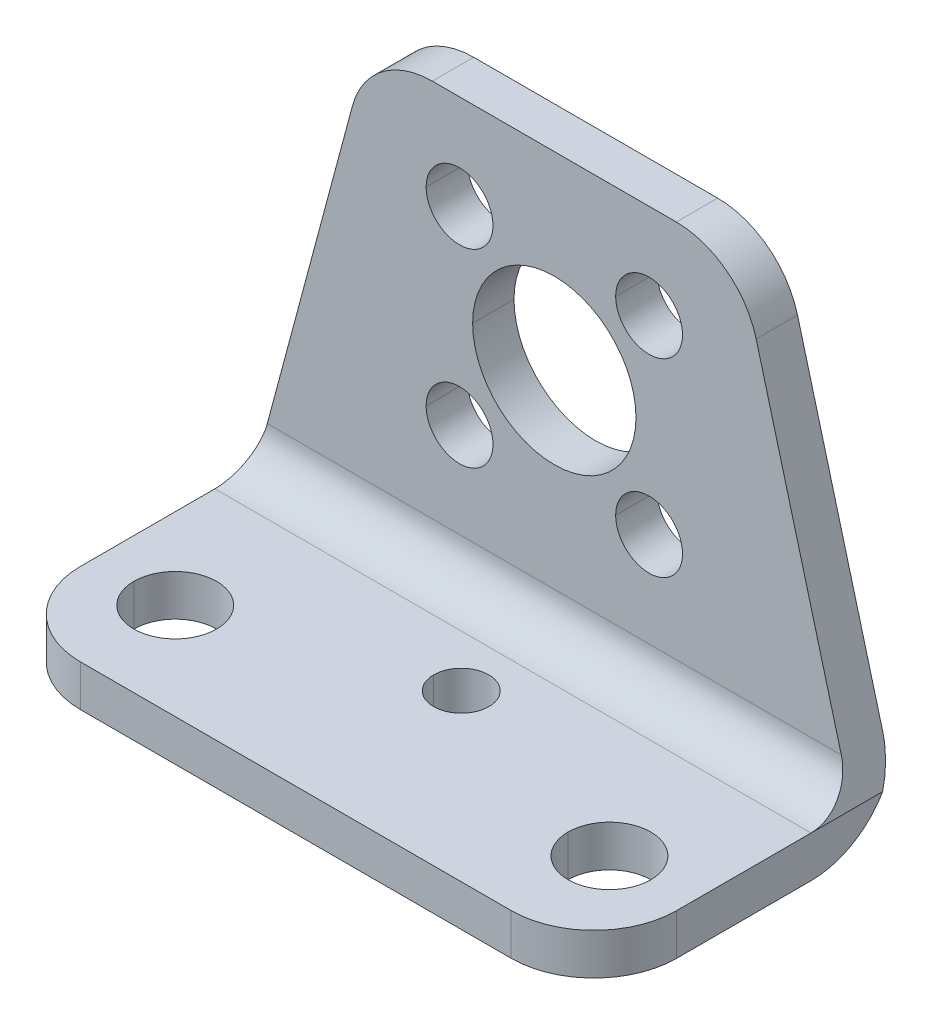
ISO-10303-21;
HEADER;
FILE_DESCRIPTION(('STEP AP214'),'2;1');
FILE_NAME('part.step','',(''),(''),'','','');
FILE_SCHEMA(('AUTOMOTIVE_DESIGN { 1 0 10303 214 1 1 1 1 }'));
ENDSEC;
DATA;
#1=APPLICATION_CONTEXT('core data for automotive mechanical design processes');
#2=APPLICATION_PROTOCOL_DEFINITION('international standard','automotive_design',2000,#1);
#3=PRODUCT_CONTEXT('',#1,'mechanical');
#4=PRODUCT('Part','Part','',(#3));
#5=PRODUCT_RELATED_PRODUCT_CATEGORY('part','',(#4));
#6=PRODUCT_DEFINITION_FORMATION('','',#4);
#7=PRODUCT_DEFINITION_CONTEXT('part definition',#1,'design');
#8=PRODUCT_DEFINITION('design','',#6,#7);
#9=PRODUCT_DEFINITION_SHAPE('','',#8);
#10=(LENGTH_UNIT() NAMED_UNIT(*) SI_UNIT(.MILLI.,.METRE.));
#11=(NAMED_UNIT(*) PLANE_ANGLE_UNIT() SI_UNIT($,.RADIAN.));
#12=(NAMED_UNIT(*) SI_UNIT($,.STERADIAN.) SOLID_ANGLE_UNIT());
#13=UNCERTAINTY_MEASURE_WITH_UNIT(LENGTH_MEASURE(1.E-05),#10,'distance_accuracy_value','');
#14=(GEOMETRIC_REPRESENTATION_CONTEXT(3) GLOBAL_UNCERTAINTY_ASSIGNED_CONTEXT((#13)) GLOBAL_UNIT_ASSIGNED_CONTEXT((#10,
#11,#12)) REPRESENTATION_CONTEXT('',''));
#15=CARTESIAN_POINT('',(0.,0.,0.));
#16=DIRECTION('',(0.,0.,1.));
#17=DIRECTION('',(1.,0.,0.));
#18=AXIS2_PLACEMENT_3D('',#15,#16,#17);
#19=CARTESIAN_POINT('',(-8.99016510622397,7.87399999999886,6.096));
#20=DIRECTION('',(0.,0.,1.));
#21=DIRECTION('',(0.608761429008703,-0.793353340291249,0.));
#22=AXIS2_PLACEMENT_3D('',#19,#20,#21);
#23=CYLINDRICAL_SURFACE('',#22,6.096);
#24=DIRECTION('',(0.,0.,-1.));
#25=VECTOR('',#24,1.);
#26=CARTESIAN_POINT('',(-8.99016510622461,13.97,6.096));
#27=LINE('',#26,#25);
#28=CARTESIAN_POINT('',(-8.99016510622461,13.97,3.048));
#29=VERTEX_POINT('',#28);
#30=CARTESIAN_POINT('',(-8.99016510622461,13.97,0.));
#31=VERTEX_POINT('',#30);
#32=EDGE_CURVE('E11',#29,#31,#27,.T.);
#33=ORIENTED_EDGE('',*,*,#32,.T.);
#34=CARTESIAN_POINT('',(-8.99016510622397,7.87399999999886,0.));
#35=DIRECTION('',(0.,0.,1.));
#36=DIRECTION('',(1.,0.,0.));
#37=AXIS2_PLACEMENT_3D('',#34,#35,#36);
#38=CIRCLE('',#37,6.096);
#39=CARTESIAN_POINT('',(-14.878448943283,9.45176089894499,0.));
#40=VERTEX_POINT('',#39);
#41=EDGE_CURVE('E25',#31,#40,#38,.T.);
#42=ORIENTED_EDGE('',*,*,#41,.T.);
#43=DIRECTION('',(0.,0.,-1.));
#44=VECTOR('',#43,1.);
#45=CARTESIAN_POINT('',(-14.878448943283,9.45176089894499,6.096));
#46=LINE('',#45,#44);
#47=CARTESIAN_POINT('',(-14.878448943283,9.45176089894499,3.048));
#48=VERTEX_POINT('',#47);
#49=EDGE_CURVE('E523',#48,#40,#46,.T.);
#50=ORIENTED_EDGE('',*,*,#49,.F.);
#51=CARTESIAN_POINT('',(-8.99016510622397,7.87399999999886,3.048));
#52=DIRECTION('',(0.,0.,-1.));
#53=DIRECTION('',(-1.,0.,0.));
#54=AXIS2_PLACEMENT_3D('',#51,#52,#53);
#55=CIRCLE('',#54,6.096);
#56=EDGE_CURVE('E519',#48,#29,#55,.T.);
#57=ORIENTED_EDGE('',*,*,#56,.T.);
#58=EDGE_LOOP('',(#33,#42,#50,#57));
#59=FACE_BOUND('',#58,.T.);
#60=ADVANCED_FACE('F17',(#59),#23,.T.);
#61=CARTESIAN_POINT('',(21.971,13.97,3.048));
#62=DIRECTION('',(0.,0.,-1.));
#63=DIRECTION('',(-1.,0.,0.));
#64=AXIS2_PLACEMENT_3D('',#61,#62,#63);
#65=PLANE('',#64);
#66=CARTESIAN_POINT('',(0.,0.,3.048));
#67=DIRECTION('',(0.,0.,1.));
#68=DIRECTION('',(1.,0.,0.));
#69=AXIS2_PLACEMENT_3D('',#66,#67,#68);
#70=CIRCLE('',#69,6.0198);
#71=CARTESIAN_POINT('',(6.0198,0.,3.048));
#72=VERTEX_POINT('',#71);
#73=CARTESIAN_POINT('',(-6.0198,0.,3.048));
#74=VERTEX_POINT('',#73);
#75=EDGE_CURVE('E514',#72,#74,#70,.T.);
#76=ORIENTED_EDGE('',*,*,#75,.F.);
#77=CARTESIAN_POINT('',(0.,0.,3.048));
#78=DIRECTION('',(0.,0.,1.));
#79=DIRECTION('',(1.,0.,0.));
#80=AXIS2_PLACEMENT_3D('',#77,#78,#79);
#81=CIRCLE('',#80,6.0198);
#82=EDGE_CURVE('E509',#74,#72,#81,.T.);
#83=ORIENTED_EDGE('',*,*,#82,.F.);
#84=EDGE_LOOP('',(#76,#83));
#85=FACE_BOUND('',#84,.T.);
#86=CARTESIAN_POINT('',(-6.985,6.985,3.048));
#87=DIRECTION('',(0.,0.,1.));
#88=DIRECTION('',(1.,0.,0.));
#89=AXIS2_PLACEMENT_3D('',#86,#87,#88);
#90=CIRCLE('',#89,2.4638);
#91=CARTESIAN_POINT('',(-4.5212,6.985,3.048));
#92=VERTEX_POINT('',#91);
#93=CARTESIAN_POINT('',(-9.4488,6.985,3.048));
#94=VERTEX_POINT('',#93);
#95=EDGE_CURVE('E504',#92,#94,#90,.T.);
#96=ORIENTED_EDGE('',*,*,#95,.F.);
#97=CARTESIAN_POINT('',(-6.985,6.985,3.048));
#98=DIRECTION('',(0.,0.,1.));
#99=DIRECTION('',(1.,0.,0.));
#100=AXIS2_PLACEMENT_3D('',#97,#98,#99);
#101=CIRCLE('',#100,2.4638);
#102=EDGE_CURVE('E499',#94,#92,#101,.T.);
#103=ORIENTED_EDGE('',*,*,#102,.F.);
#104=EDGE_LOOP('',(#96,#103));
#105=FACE_BOUND('',#104,.T.);
#106=CARTESIAN_POINT('',(6.985,6.985,3.048));
#107=DIRECTION('',(0.,0.,1.));
#108=DIRECTION('',(1.,0.,0.));
#109=AXIS2_PLACEMENT_3D('',#106,#107,#108);
#110=CIRCLE('',#109,2.4638);
#111=CARTESIAN_POINT('',(9.4488,6.985,3.048));
#112=VERTEX_POINT('',#111);
#113=CARTESIAN_POINT('',(4.5212,6.985,3.048));
#114=VERTEX_POINT('',#113);
#115=EDGE_CURVE('E494',#112,#114,#110,.T.);
#116=ORIENTED_EDGE('',*,*,#115,.F.);
#117=CARTESIAN_POINT('',(6.985,6.985,3.048));
#118=DIRECTION('',(0.,0.,1.));
#119=DIRECTION('',(1.,0.,0.));
#120=AXIS2_PLACEMENT_3D('',#117,#118,#119);
#121=CIRCLE('',#120,2.4638);
#122=EDGE_CURVE('E489',#114,#112,#121,.T.);
#123=ORIENTED_EDGE('',*,*,#122,.F.);
#124=EDGE_LOOP('',(#116,#123));
#125=FACE_BOUND('',#124,.T.);
#126=CARTESIAN_POINT('',(-6.985,-6.985,3.048));
#127=DIRECTION('',(0.,0.,1.));
#128=DIRECTION('',(1.,0.,0.));
#129=AXIS2_PLACEMENT_3D('',#126,#127,#128);
#130=CIRCLE('',#129,2.4638);
#131=CARTESIAN_POINT('',(-4.5212,-6.985,3.048));
#132=VERTEX_POINT('',#131);
#133=CARTESIAN_POINT('',(-9.4488,-6.985,3.048));
#134=VERTEX_POINT('',#133);
#135=EDGE_CURVE('E484',#132,#134,#130,.T.);
#136=ORIENTED_EDGE('',*,*,#135,.F.);
#137=CARTESIAN_POINT('',(-6.985,-6.985,3.048));
#138=DIRECTION('',(0.,0.,1.));
#139=DIRECTION('',(1.,0.,0.));
#140=AXIS2_PLACEMENT_3D('',#137,#138,#139);
#141=CIRCLE('',#140,2.4638);
#142=EDGE_CURVE('E479',#134,#132,#141,.T.);
#143=ORIENTED_EDGE('',*,*,#142,.F.);
#144=EDGE_LOOP('',(#136,#143));
#145=FACE_BOUND('',#144,.T.);
#146=CARTESIAN_POINT('',(6.985,-6.985,3.048));
#147=DIRECTION('',(0.,0.,1.));
#148=DIRECTION('',(1.,0.,0.));
#149=AXIS2_PLACEMENT_3D('',#146,#147,#148);
#150=CIRCLE('',#149,2.4638);
#151=CARTESIAN_POINT('',(9.4488,-6.985,3.048));
#152=VERTEX_POINT('',#151);
#153=CARTESIAN_POINT('',(4.5212,-6.985,3.048));
#154=VERTEX_POINT('',#153);
#155=EDGE_CURVE('E474',#152,#154,#150,.T.);
#156=ORIENTED_EDGE('',*,*,#155,.F.);
#157=CARTESIAN_POINT('',(6.985,-6.985,3.048));
#158=DIRECTION('',(0.,0.,1.));
#159=DIRECTION('',(1.,0.,0.));
#160=AXIS2_PLACEMENT_3D('',#157,#158,#159);
#161=CIRCLE('',#160,2.4638);
#162=EDGE_CURVE('E469',#154,#152,#161,.T.);
#163=ORIENTED_EDGE('',*,*,#162,.F.);
#164=EDGE_LOOP('',(#156,#163));
#165=FACE_BOUND('',#164,.T.);
#166=DIRECTION('',(0.258819045102513,0.96592582628907,0.));
#167=VECTOR('',#166,1.);
#168=CARTESIAN_POINT('',(-11.2804441465483,22.8796976062359,3.048));
#169=LINE('',#168,#167);
#170=CARTESIAN_POINT('',(-21.15429086147,-13.97,3.048));
#171=VERTEX_POINT('',#170);
#172=EDGE_CURVE('E464',#171,#48,#169,.T.);
#173=ORIENTED_EDGE('',*,*,#172,.F.);
#174=DIRECTION('',(-1.,0.,0.));
#175=VECTOR('',#174,1.);
#176=CARTESIAN_POINT('',(21.971,-13.97,3.048));
#177=LINE('',#176,#175);
#178=CARTESIAN_POINT('',(21.15429086147,-13.97,3.048));
#179=VERTEX_POINT('',#178);
#180=EDGE_CURVE('E459',#179,#171,#177,.T.);
#181=ORIENTED_EDGE('',*,*,#180,.F.);
#182=DIRECTION('',(0.258819045102513,-0.96592582628907,0.));
#183=VECTOR('',#182,1.);
#184=CARTESIAN_POINT('',(14.2240000000002,11.8941976062362,3.048));
#185=LINE('',#184,#183);
#186=CARTESIAN_POINT('',(14.878448943283,9.45176089894499,3.048));
#187=VERTEX_POINT('',#186);
#188=EDGE_CURVE('E454',#187,#179,#185,.T.);
#189=ORIENTED_EDGE('',*,*,#188,.F.);
#190=CARTESIAN_POINT('',(8.99016510622397,7.87399999999886,3.048));
#191=DIRECTION('',(0.,0.,-1.));
#192=DIRECTION('',(-1.,0.,0.));
#193=AXIS2_PLACEMENT_3D('',#190,#191,#192);
#194=CIRCLE('',#193,6.096);
#195=CARTESIAN_POINT('',(8.99016510622461,13.97,3.048));
#196=VERTEX_POINT('',#195);
#197=EDGE_CURVE('E449',#196,#187,#194,.T.);
#198=ORIENTED_EDGE('',*,*,#197,.F.);
#199=DIRECTION('',(-1.,0.,0.));
#200=VECTOR('',#199,1.);
#201=CARTESIAN_POINT('',(21.971,13.97,3.048));
#202=LINE('',#201,#200);
#203=EDGE_CURVE('E444',#196,#29,#202,.T.);
#204=ORIENTED_EDGE('',*,*,#203,.T.);
#205=ORIENTED_EDGE('',*,*,#56,.F.);
#206=EDGE_LOOP('',(#173,#181,#189,#198,#204,#205));
#207=FACE_BOUND('',#206,.T.);
#208=ADVANCED_FACE('F538',(#85,#105,#125,#145,#165,#207),#65,.F.);
#209=CARTESIAN_POINT('',(21.971,13.97,0.));
#210=DIRECTION('',(0.,-1.,0.));
#211=DIRECTION('',(0.,0.,-1.));
#212=AXIS2_PLACEMENT_3D('',#209,#210,#211);
#213=PLANE('',#212);
#214=DIRECTION('',(-1.,0.,0.));
#215=VECTOR('',#214,1.);
#216=CARTESIAN_POINT('',(21.971,13.97,0.));
#217=LINE('',#216,#215);
#218=CARTESIAN_POINT('',(8.99016510622461,13.97,0.));
#219=VERTEX_POINT('',#218);
#220=EDGE_CURVE('E440',#219,#31,#217,.T.);
#221=ORIENTED_EDGE('',*,*,#220,.T.);
#222=ORIENTED_EDGE('',*,*,#32,.F.);
#223=ORIENTED_EDGE('',*,*,#203,.F.);
#224=DIRECTION('',(0.,0.,-1.));
#225=VECTOR('',#224,1.);
#226=CARTESIAN_POINT('',(8.99016510622461,13.97,6.096));
#227=LINE('',#226,#225);
#228=EDGE_CURVE('E436',#196,#219,#227,.T.);
#229=ORIENTED_EDGE('',*,*,#228,.T.);
#230=EDGE_LOOP('',(#221,#222,#223,#229));
#231=FACE_BOUND('',#230,.T.);
#232=ADVANCED_FACE('F542',(#231),#213,.F.);
#233=CARTESIAN_POINT('',(8.99016510622397,7.87399999999886,6.096));
#234=DIRECTION('',(0.,0.,1.));
#235=DIRECTION('',(-0.608761429008703,-0.793353340291248,0.));
#236=AXIS2_PLACEMENT_3D('',#233,#234,#235);
#237=CYLINDRICAL_SURFACE('',#236,6.096);
#238=DIRECTION('',(0.,0.,-1.));
#239=VECTOR('',#238,1.);
#240=CARTESIAN_POINT('',(14.878448943283,9.45176089894499,6.096));
#241=LINE('',#240,#239);
#242=CARTESIAN_POINT('',(14.878448943283,9.45176089894499,0.));
#243=VERTEX_POINT('',#242);
#244=EDGE_CURVE('E432',#187,#243,#241,.T.);
#245=ORIENTED_EDGE('',*,*,#244,.T.);
#246=CARTESIAN_POINT('',(8.99016510622397,7.87399999999886,0.));
#247=DIRECTION('',(0.,0.,1.));
#248=DIRECTION('',(1.,0.,0.));
#249=AXIS2_PLACEMENT_3D('',#246,#247,#248);
#250=CIRCLE('',#249,6.096);
#251=EDGE_CURVE('E427',#243,#219,#250,.T.);
#252=ORIENTED_EDGE('',*,*,#251,.T.);
#253=ORIENTED_EDGE('',*,*,#228,.F.);
#254=ORIENTED_EDGE('',*,*,#197,.T.);
#255=EDGE_LOOP('',(#245,#252,#253,#254));
#256=FACE_BOUND('',#255,.T.);
#257=ADVANCED_FACE('F569',(#256),#237,.T.);
#258=CARTESIAN_POINT('',(21.971,-13.97,0.));
#259=DIRECTION('',(0.,0.,1.));
#260=DIRECTION('',(1.,0.,0.));
#261=AXIS2_PLACEMENT_3D('',#258,#259,#260);
#262=PLANE('',#261);
#263=CARTESIAN_POINT('',(0.,0.,0.));
#264=DIRECTION('',(0.,0.,1.));
#265=DIRECTION('',(1.,0.,0.));
#266=AXIS2_PLACEMENT_3D('',#263,#264,#265);
#267=CIRCLE('',#266,6.0198);
#268=CARTESIAN_POINT('',(6.0198,0.,0.));
#269=VERTEX_POINT('',#268);
#270=CARTESIAN_POINT('',(-6.0198,0.,0.));
#271=VERTEX_POINT('',#270);
#272=EDGE_CURVE('E423',#269,#271,#267,.T.);
#273=ORIENTED_EDGE('',*,*,#272,.T.);
#274=CARTESIAN_POINT('',(0.,0.,0.));
#275=DIRECTION('',(0.,0.,1.));
#276=DIRECTION('',(1.,0.,0.));
#277=AXIS2_PLACEMENT_3D('',#274,#275,#276);
#278=CIRCLE('',#277,6.0198);
#279=EDGE_CURVE('E419',#271,#269,#278,.T.);
#280=ORIENTED_EDGE('',*,*,#279,.T.);
#281=EDGE_LOOP('',(#273,#280));
#282=FACE_BOUND('',#281,.T.);
#283=CARTESIAN_POINT('',(-6.985,6.985,0.));
#284=DIRECTION('',(0.,0.,1.));
#285=DIRECTION('',(1.,0.,0.));
#286=AXIS2_PLACEMENT_3D('',#283,#284,#285);
#287=CIRCLE('',#286,2.4638);
#288=CARTESIAN_POINT('',(-4.5212,6.985,0.));
#289=VERTEX_POINT('',#288);
#290=CARTESIAN_POINT('',(-9.4488,6.985,0.));
#291=VERTEX_POINT('',#290);
#292=EDGE_CURVE('E415',#289,#291,#287,.T.);
#293=ORIENTED_EDGE('',*,*,#292,.T.);
#294=CARTESIAN_POINT('',(-6.985,6.985,0.));
#295=DIRECTION('',(0.,0.,1.));
#296=DIRECTION('',(1.,0.,0.));
#297=AXIS2_PLACEMENT_3D('',#294,#295,#296);
#298=CIRCLE('',#297,2.4638);
#299=EDGE_CURVE('E411',#291,#289,#298,.T.);
#300=ORIENTED_EDGE('',*,*,#299,.T.);
#301=EDGE_LOOP('',(#293,#300));
#302=FACE_BOUND('',#301,.T.);
#303=CARTESIAN_POINT('',(6.985,6.985,0.));
#304=DIRECTION('',(0.,0.,1.));
#305=DIRECTION('',(1.,0.,0.));
#306=AXIS2_PLACEMENT_3D('',#303,#304,#305);
#307=CIRCLE('',#306,2.4638);
#308=CARTESIAN_POINT('',(9.4488,6.985,0.));
#309=VERTEX_POINT('',#308);
#310=CARTESIAN_POINT('',(4.5212,6.985,0.));
#311=VERTEX_POINT('',#310);
#312=EDGE_CURVE('E407',#309,#311,#307,.T.);
#313=ORIENTED_EDGE('',*,*,#312,.T.);
#314=CARTESIAN_POINT('',(6.985,6.985,0.));
#315=DIRECTION('',(0.,0.,1.));
#316=DIRECTION('',(1.,0.,0.));
#317=AXIS2_PLACEMENT_3D('',#314,#315,#316);
#318=CIRCLE('',#317,2.4638);
#319=EDGE_CURVE('E403',#311,#309,#318,.T.);
#320=ORIENTED_EDGE('',*,*,#319,.T.);
#321=EDGE_LOOP('',(#313,#320));
#322=FACE_BOUND('',#321,.T.);
#323=CARTESIAN_POINT('',(-6.985,-6.985,0.));
#324=DIRECTION('',(0.,0.,1.));
#325=DIRECTION('',(1.,0.,0.));
#326=AXIS2_PLACEMENT_3D('',#323,#324,#325);
#327=CIRCLE('',#326,2.4638);
#328=CARTESIAN_POINT('',(-4.5212,-6.985,0.));
#329=VERTEX_POINT('',#328);
#330=CARTESIAN_POINT('',(-9.4488,-6.985,0.));
#331=VERTEX_POINT('',#330);
#332=EDGE_CURVE('E399',#329,#331,#327,.T.);
#333=ORIENTED_EDGE('',*,*,#332,.T.);
#334=CARTESIAN_POINT('',(-6.985,-6.985,0.));
#335=DIRECTION('',(0.,0.,1.));
#336=DIRECTION('',(1.,0.,0.));
#337=AXIS2_PLACEMENT_3D('',#334,#335,#336);
#338=CIRCLE('',#337,2.4638);
#339=EDGE_CURVE('E395',#331,#329,#338,.T.);
#340=ORIENTED_EDGE('',*,*,#339,.T.);
#341=EDGE_LOOP('',(#333,#340));
#342=FACE_BOUND('',#341,.T.);
#343=CARTESIAN_POINT('',(6.985,-6.985,0.));
#344=DIRECTION('',(0.,0.,1.));
#345=DIRECTION('',(1.,0.,0.));
#346=AXIS2_PLACEMENT_3D('',#343,#344,#345);
#347=CIRCLE('',#346,2.4638);
#348=CARTESIAN_POINT('',(9.4488,-6.985,0.));
#349=VERTEX_POINT('',#348);
#350=CARTESIAN_POINT('',(4.5212,-6.985,0.));
#351=VERTEX_POINT('',#350);
#352=EDGE_CURVE('E391',#349,#351,#347,.T.);
#353=ORIENTED_EDGE('',*,*,#352,.T.);
#354=CARTESIAN_POINT('',(6.985,-6.985,0.));
#355=DIRECTION('',(0.,0.,1.));
#356=DIRECTION('',(1.,0.,0.));
#357=AXIS2_PLACEMENT_3D('',#354,#355,#356);
#358=CIRCLE('',#357,2.4638);
#359=EDGE_CURVE('E387',#351,#349,#358,.T.);
#360=ORIENTED_EDGE('',*,*,#359,.T.);
#361=EDGE_LOOP('',(#353,#360));
#362=FACE_BOUND('',#361,.T.);
#363=DIRECTION('',(0.258819045102513,0.96592582628907,0.));
#364=VECTOR('',#363,1.);
#365=CARTESIAN_POINT('',(-21.971,-17.018,0.));
#366=LINE('',#365,#364);
#367=CARTESIAN_POINT('',(-21.15429086147,-13.97,0.));
#368=VERTEX_POINT('',#367);
#369=EDGE_CURVE('E383',#368,#40,#366,.T.);
#370=ORIENTED_EDGE('',*,*,#369,.T.);
#371=ORIENTED_EDGE('',*,*,#41,.F.);
#372=ORIENTED_EDGE('',*,*,#220,.F.);
#373=ORIENTED_EDGE('',*,*,#251,.F.);
#374=DIRECTION('',(0.258819045102513,-0.96592582628907,0.));
#375=VECTOR('',#374,1.);
#376=CARTESIAN_POINT('',(14.878448943283,9.45176089894499,0.));
#377=LINE('',#376,#375);
#378=CARTESIAN_POINT('',(21.15429086147,-13.97,0.));
#379=VERTEX_POINT('',#378);
#380=EDGE_CURVE('E379',#243,#379,#377,.T.);
#381=ORIENTED_EDGE('',*,*,#380,.T.);
#382=DIRECTION('',(-1.,0.,0.));
#383=VECTOR('',#382,1.);
#384=CARTESIAN_POINT('',(21.971,-13.97,0.));
#385=LINE('',#384,#383);
#386=EDGE_CURVE('E375',#379,#368,#385,.T.);
#387=ORIENTED_EDGE('',*,*,#386,.T.);
#388=EDGE_LOOP('',(#370,#371,#372,#373,#381,#387));
#389=FACE_BOUND('',#388,.T.);
#390=ADVANCED_FACE('F546',(#282,#302,#322,#342,#362,#389),#262,.F.);
#391=CARTESIAN_POINT('',(21.971,-13.9699999999997,6.09600000000033));
#392=DIRECTION('',(1.,0.,0.));
#393=DIRECTION('',(0.,0.707106781186548,0.707106781186547));
#394=AXIS2_PLACEMENT_3D('',#391,#392,#393);
#395=CYLINDRICAL_SURFACE('',#394,6.096);
#396=CARTESIAN_POINT('',(-21.1542908614699,-13.9699999999997,6.09600000000033));
#397=DIRECTION('',(-0.96592582628907,0.258819045102513,0.));
#398=DIRECTION('',(-0.258819045102513,-0.96592582628907,0.));
#399=AXIS2_PLACEMENT_3D('',#396,#397,#398);
#400=ELLIPSE('',#399,6.31104359582,6.096);
#401=CARTESIAN_POINT('',(-21.971,-17.018,0.816709138530201));
#402=VERTEX_POINT('',#401);
#403=EDGE_CURVE('E370',#368,#402,#400,.T.);
#404=ORIENTED_EDGE('',*,*,#403,.F.);
#405=ORIENTED_EDGE('',*,*,#386,.F.);
#406=CARTESIAN_POINT('',(21.1542908614699,-13.9699999999997,6.09600000000033));
#407=DIRECTION('',(0.96592582628907,0.258819045102513,0.));
#408=DIRECTION('',(-0.258819045102513,0.96592582628907,0.));
#409=AXIS2_PLACEMENT_3D('',#406,#407,#408);
#410=ELLIPSE('',#409,6.31104359582,6.096);
#411=CARTESIAN_POINT('',(21.971,-17.018,0.816709138530204));
#412=VERTEX_POINT('',#411);
#413=EDGE_CURVE('E365',#412,#379,#410,.T.);
#414=ORIENTED_EDGE('',*,*,#413,.F.);
#415=CARTESIAN_POINT('',(21.971,-13.9699999999997,6.09600000000033));
#416=DIRECTION('',(1.,0.,0.));
#417=DIRECTION('',(0.,0.,-1.));
#418=AXIS2_PLACEMENT_3D('',#415,#416,#417);
#419=CIRCLE('',#418,6.096);
#420=CARTESIAN_POINT('',(21.971,-20.066,6.096));
#421=VERTEX_POINT('',#420);
#422=EDGE_CURVE('E360',#421,#412,#419,.T.);
#423=ORIENTED_EDGE('',*,*,#422,.F.);
#424=DIRECTION('',(-1.,0.,0.));
#425=VECTOR('',#424,1.);
#426=CARTESIAN_POINT('',(21.971,-20.066,6.096));
#427=LINE('',#426,#425);
#428=CARTESIAN_POINT('',(-21.971,-20.066,6.096));
#429=VERTEX_POINT('',#428);
#430=EDGE_CURVE('E356',#421,#429,#427,.T.);
#431=ORIENTED_EDGE('',*,*,#430,.T.);
#432=CARTESIAN_POINT('',(-21.971,-13.9699999999997,6.09600000000033));
#433=DIRECTION('',(1.,0.,0.));
#434=DIRECTION('',(0.,0.,-1.));
#435=AXIS2_PLACEMENT_3D('',#432,#433,#434);
#436=CIRCLE('',#435,6.096);
#437=EDGE_CURVE('E352',#429,#402,#436,.T.);
#438=ORIENTED_EDGE('',*,*,#437,.T.);
#439=EDGE_LOOP('',(#404,#405,#414,#423,#431,#438));
#440=FACE_BOUND('',#439,.T.);
#441=ADVANCED_FACE('F551',(#440),#395,.T.);
#442=CARTESIAN_POINT('',(-21.971,-13.9699999999997,6.09600000000033));
#443=DIRECTION('',(1.,0.,0.));
#444=DIRECTION('',(0.,0.,-1.));
#445=AXIS2_PLACEMENT_3D('',#442,#443,#444);
#446=PLANE('',#445);
#447=DIRECTION('',(0.,0.,-1.));
#448=VECTOR('',#447,1.);
#449=CARTESIAN_POINT('',(-21.971,-20.066,22.098));
#450=LINE('',#449,#448);
#451=CARTESIAN_POINT('',(-21.971,-20.066,16.002));
#452=VERTEX_POINT('',#451);
#453=EDGE_CURVE('E347',#452,#429,#450,.T.);
#454=ORIENTED_EDGE('',*,*,#453,.F.);
#455=DIRECTION('',(0.,-1.,0.));
#456=VECTOR('',#455,1.);
#457=CARTESIAN_POINT('',(-21.971,-17.018,16.002));
#458=LINE('',#457,#456);
#459=CARTESIAN_POINT('',(-21.971,-17.018,16.002));
#460=VERTEX_POINT('',#459);
#461=EDGE_CURVE('E342',#460,#452,#458,.T.);
#462=ORIENTED_EDGE('',*,*,#461,.F.);
#463=DIRECTION('',(0.,0.,1.));
#464=VECTOR('',#463,1.);
#465=CARTESIAN_POINT('',(-21.971,-17.018,6.096));
#466=LINE('',#465,#464);
#467=CARTESIAN_POINT('',(-21.971,-17.018,6.096));
#468=VERTEX_POINT('',#467);
#469=EDGE_CURVE('E337',#468,#460,#466,.T.);
#470=ORIENTED_EDGE('',*,*,#469,.F.);
#471=DIRECTION('',(0.,0.,-1.));
#472=VECTOR('',#471,1.);
#473=CARTESIAN_POINT('',(-21.971,-17.018,6.096));
#474=LINE('',#473,#472);
#475=EDGE_CURVE('E332',#468,#402,#474,.T.);
#476=ORIENTED_EDGE('',*,*,#475,.T.);
#477=ORIENTED_EDGE('',*,*,#437,.F.);
#478=EDGE_LOOP('',(#454,#462,#470,#476,#477));
#479=FACE_BOUND('',#478,.T.);
#480=ADVANCED_FACE('F570',(#479),#446,.F.);
#481=CARTESIAN_POINT('',(-21.971,-17.018,6.096));
#482=DIRECTION('',(-0.96592582628907,0.258819045102513,0.));
#483=DIRECTION('',(-0.258819045102513,-0.96592582628907,0.));
#484=AXIS2_PLACEMENT_3D('',#481,#482,#483);
#485=PLANE('',#484);
#486=ORIENTED_EDGE('',*,*,#403,.T.);
#487=ORIENTED_EDGE('',*,*,#475,.F.);
#488=CARTESIAN_POINT('',(-21.1542908614702,-13.9700000000007,6.09599999999931));
#489=DIRECTION('',(-0.96592582628907,0.258819045102513,0.));
#490=DIRECTION('',(-0.258819045102513,-0.96592582628907,0.));
#491=AXIS2_PLACEMENT_3D('',#488,#489,#490);
#492=ELLIPSE('',#491,3.15552179664,3.048);
#493=EDGE_CURVE('E327',#171,#468,#492,.T.);
#494=ORIENTED_EDGE('',*,*,#493,.F.);
#495=ORIENTED_EDGE('',*,*,#172,.T.);
#496=ORIENTED_EDGE('',*,*,#49,.T.);
#497=ORIENTED_EDGE('',*,*,#369,.F.);
#498=EDGE_LOOP('',(#486,#487,#494,#495,#496,#497));
#499=FACE_BOUND('',#498,.T.);
#500=ADVANCED_FACE('F534',(#499),#485,.T.);
#501=CARTESIAN_POINT('',(21.971,-13.9700000000007,6.09599999999931));
#502=DIRECTION('',(1.,0.,0.));
#503=DIRECTION('',(0.,0.707106781186547,0.707106781186548));
#504=AXIS2_PLACEMENT_3D('',#501,#502,#503);
#505=CYLINDRICAL_SURFACE('',#504,3.048);
#506=CARTESIAN_POINT('',(21.1542908614702,-13.9700000000007,6.09599999999931));
#507=DIRECTION('',(0.96592582628907,0.258819045102513,0.));
#508=DIRECTION('',(-0.258819045102513,0.96592582628907,0.));
#509=AXIS2_PLACEMENT_3D('',#506,#507,#508);
#510=ELLIPSE('',#509,3.15552179664,3.048);
#511=CARTESIAN_POINT('',(21.971,-17.018,6.096));
#512=VERTEX_POINT('',#511);
#513=EDGE_CURVE('E322',#512,#179,#510,.T.);
#514=ORIENTED_EDGE('',*,*,#513,.T.);
#515=ORIENTED_EDGE('',*,*,#180,.T.);
#516=ORIENTED_EDGE('',*,*,#493,.T.);
#517=DIRECTION('',(-1.,0.,0.));
#518=VECTOR('',#517,1.);
#519=CARTESIAN_POINT('',(21.971,-17.018,6.096));
#520=LINE('',#519,#518);
#521=EDGE_CURVE('E317',#512,#468,#520,.T.);
#522=ORIENTED_EDGE('',*,*,#521,.F.);
#523=EDGE_LOOP('',(#514,#515,#516,#522));
#524=FACE_BOUND('',#523,.T.);
#525=ADVANCED_FACE('F556',(#524),#505,.F.);
#526=CARTESIAN_POINT('',(21.971,-17.018,6.096));
#527=DIRECTION('',(0.,-1.,0.));
#528=DIRECTION('',(0.,0.,-1.));
#529=AXIS2_PLACEMENT_3D('',#526,#527,#528);
#530=PLANE('',#529);
#531=CARTESIAN_POINT('',(0.,-17.018,9.906));
#532=DIRECTION('',(0.,1.,0.));
#533=DIRECTION('',(1.,0.,0.));
#534=AXIS2_PLACEMENT_3D('',#531,#532,#533);
#535=CIRCLE('',#534,2.032);
#536=CARTESIAN_POINT('',(2.032,-17.018,9.906));
#537=VERTEX_POINT('',#536);
#538=CARTESIAN_POINT('',(-2.032,-17.018,9.906));
#539=VERTEX_POINT('',#538);
#540=EDGE_CURVE('E312',#537,#539,#535,.T.);
#541=ORIENTED_EDGE('',*,*,#540,.F.);
#542=CARTESIAN_POINT('',(0.,-17.018,9.906));
#543=DIRECTION('',(0.,1.,0.));
#544=DIRECTION('',(1.,0.,0.));
#545=AXIS2_PLACEMENT_3D('',#542,#543,#544);
#546=CIRCLE('',#545,2.032);
#547=EDGE_CURVE('E307',#539,#537,#546,.T.);
#548=ORIENTED_EDGE('',*,*,#547,.F.);
#549=EDGE_LOOP('',(#541,#548));
#550=FACE_BOUND('',#549,.T.);
#551=CARTESIAN_POINT('',(-16.002,-17.018,14.986));
#552=DIRECTION('',(0.,1.,0.));
#553=DIRECTION('',(1.,0.,0.));
#554=AXIS2_PLACEMENT_3D('',#551,#552,#553);
#555=CIRCLE('',#554,3.048);
#556=CARTESIAN_POINT('',(-12.954,-17.018,14.986));
#557=VERTEX_POINT('',#556);
#558=CARTESIAN_POINT('',(-19.05,-17.018,14.986));
#559=VERTEX_POINT('',#558);
#560=EDGE_CURVE('E302',#557,#559,#555,.T.);
#561=ORIENTED_EDGE('',*,*,#560,.F.);
#562=CARTESIAN_POINT('',(-16.002,-17.018,14.986));
#563=DIRECTION('',(0.,1.,0.));
#564=DIRECTION('',(1.,0.,0.));
#565=AXIS2_PLACEMENT_3D('',#562,#563,#564);
#566=CIRCLE('',#565,3.048);
#567=EDGE_CURVE('E297',#559,#557,#566,.T.);
#568=ORIENTED_EDGE('',*,*,#567,.F.);
#569=EDGE_LOOP('',(#561,#568));
#570=FACE_BOUND('',#569,.T.);
#571=CARTESIAN_POINT('',(16.002,-17.018,14.986));
#572=DIRECTION('',(0.,1.,0.));
#573=DIRECTION('',(1.,0.,0.));
#574=AXIS2_PLACEMENT_3D('',#571,#572,#573);
#575=CIRCLE('',#574,3.048);
#576=CARTESIAN_POINT('',(19.05,-17.018,14.986));
#577=VERTEX_POINT('',#576);
#578=CARTESIAN_POINT('',(12.954,-17.018,14.986));
#579=VERTEX_POINT('',#578);
#580=EDGE_CURVE('E292',#577,#579,#575,.T.);
#581=ORIENTED_EDGE('',*,*,#580,.F.);
#582=CARTESIAN_POINT('',(16.002,-17.018,14.986));
#583=DIRECTION('',(0.,1.,0.));
#584=DIRECTION('',(1.,0.,0.));
#585=AXIS2_PLACEMENT_3D('',#582,#583,#584);
#586=CIRCLE('',#585,3.048);
#587=EDGE_CURVE('E287',#579,#577,#586,.T.);
#588=ORIENTED_EDGE('',*,*,#587,.F.);
#589=EDGE_LOOP('',(#581,#588));
#590=FACE_BOUND('',#589,.T.);
#591=ORIENTED_EDGE('',*,*,#469,.T.);
#592=CARTESIAN_POINT('',(-15.8749999999993,-17.018,16.0019999999993));
#593=DIRECTION('',(0.,1.,0.));
#594=DIRECTION('',(1.,0.,0.));
#595=AXIS2_PLACEMENT_3D('',#592,#593,#594);
#596=CIRCLE('',#595,6.096);
#597=CARTESIAN_POINT('',(-15.875,-17.018,22.098));
#598=VERTEX_POINT('',#597);
#599=EDGE_CURVE('E283',#460,#598,#596,.T.);
#600=ORIENTED_EDGE('',*,*,#599,.T.);
#601=DIRECTION('',(-1.,0.,0.));
#602=VECTOR('',#601,1.);
#603=CARTESIAN_POINT('',(21.971,-17.018,22.098));
#604=LINE('',#603,#602);
#605=CARTESIAN_POINT('',(15.875,-17.018,22.098));
#606=VERTEX_POINT('',#605);
#607=EDGE_CURVE('E279',#606,#598,#604,.T.);
#608=ORIENTED_EDGE('',*,*,#607,.F.);
#609=CARTESIAN_POINT('',(15.8749999999993,-17.018,16.0019999999993));
#610=DIRECTION('',(0.,1.,0.));
#611=DIRECTION('',(1.,0.,0.));
#612=AXIS2_PLACEMENT_3D('',#609,#610,#611);
#613=CIRCLE('',#612,6.096);
#614=CARTESIAN_POINT('',(21.971,-17.018,16.002));
#615=VERTEX_POINT('',#614);
#616=EDGE_CURVE('E222',#606,#615,#613,.T.);
#617=ORIENTED_EDGE('',*,*,#616,.T.);
#618=DIRECTION('',(0.,0.,1.));
#619=VECTOR('',#618,1.);
#620=CARTESIAN_POINT('',(21.971,-17.018,6.096));
#621=LINE('',#620,#619);
#622=EDGE_CURVE('E271',#512,#615,#621,.T.);
#623=ORIENTED_EDGE('',*,*,#622,.F.);
#624=ORIENTED_EDGE('',*,*,#521,.T.);
#625=EDGE_LOOP('',(#591,#600,#608,#617,#623,#624));
#626=FACE_BOUND('',#625,.T.);
#627=ADVANCED_FACE('F559',(#550,#570,#590,#626),#530,.F.);
#628=CARTESIAN_POINT('',(21.971,-13.9699999999997,6.09600000000033));
#629=DIRECTION('',(1.,0.,0.));
#630=DIRECTION('',(0.,0.,-1.));
#631=AXIS2_PLACEMENT_3D('',#628,#629,#630);
#632=PLANE('',#631);
#633=DIRECTION('',(0.,-1.,0.));
#634=VECTOR('',#633,1.);
#635=CARTESIAN_POINT('',(21.971,-17.018,16.002));
#636=LINE('',#635,#634);
#637=CARTESIAN_POINT('',(21.971,-20.066,16.002));
#638=VERTEX_POINT('',#637);
#639=EDGE_CURVE('E267',#615,#638,#636,.T.);
#640=ORIENTED_EDGE('',*,*,#639,.T.);
#641=DIRECTION('',(0.,0.,-1.));
#642=VECTOR('',#641,1.);
#643=CARTESIAN_POINT('',(21.971,-20.066,22.098));
#644=LINE('',#643,#642);
#645=EDGE_CURVE('E213',#638,#421,#644,.T.);
#646=ORIENTED_EDGE('',*,*,#645,.T.);
#647=ORIENTED_EDGE('',*,*,#422,.T.);
#648=DIRECTION('',(0.,0.,-1.));
#649=VECTOR('',#648,1.);
#650=CARTESIAN_POINT('',(21.971,-17.018,6.096));
#651=LINE('',#650,#649);
#652=EDGE_CURVE('E259',#512,#412,#651,.T.);
#653=ORIENTED_EDGE('',*,*,#652,.F.);
#654=ORIENTED_EDGE('',*,*,#622,.T.);
#655=EDGE_LOOP('',(#640,#646,#647,#653,#654));
#656=FACE_BOUND('',#655,.T.);
#657=ADVANCED_FACE('F564',(#656),#632,.T.);
#658=CARTESIAN_POINT('',(14.878448943283,9.45176089894499,6.096));
#659=DIRECTION('',(0.96592582628907,0.258819045102513,0.));
#660=DIRECTION('',(-0.258819045102513,0.96592582628907,0.));
#661=AXIS2_PLACEMENT_3D('',#658,#659,#660);
#662=PLANE('',#661);
#663=ORIENTED_EDGE('',*,*,#413,.T.);
#664=ORIENTED_EDGE('',*,*,#380,.F.);
#665=ORIENTED_EDGE('',*,*,#244,.F.);
#666=ORIENTED_EDGE('',*,*,#188,.T.);
#667=ORIENTED_EDGE('',*,*,#513,.F.);
#668=ORIENTED_EDGE('',*,*,#652,.T.);
#669=EDGE_LOOP('',(#663,#664,#665,#666,#667,#668));
#670=FACE_BOUND('',#669,.T.);
#671=ADVANCED_FACE('F566',(#670),#662,.T.);
#672=CARTESIAN_POINT('',(21.971,-20.066,22.098));
#673=DIRECTION('',(0.,1.,0.));
#674=DIRECTION('',(0.,0.,1.));
#675=AXIS2_PLACEMENT_3D('',#672,#673,#674);
#676=PLANE('',#675);
#677=CARTESIAN_POINT('',(0.,-20.066,9.906));
#678=DIRECTION('',(0.,1.,0.));
#679=DIRECTION('',(1.,0.,0.));
#680=AXIS2_PLACEMENT_3D('',#677,#678,#679);
#681=CIRCLE('',#680,2.032);
#682=CARTESIAN_POINT('',(2.032,-20.066,9.906));
#683=VERTEX_POINT('',#682);
#684=CARTESIAN_POINT('',(-2.032,-20.066,9.906));
#685=VERTEX_POINT('',#684);
#686=EDGE_CURVE('E255',#683,#685,#681,.T.);
#687=ORIENTED_EDGE('',*,*,#686,.T.);
#688=CARTESIAN_POINT('',(0.,-20.066,9.906));
#689=DIRECTION('',(0.,1.,0.));
#690=DIRECTION('',(1.,0.,0.));
#691=AXIS2_PLACEMENT_3D('',#688,#689,#690);
#692=CIRCLE('',#691,2.032);
#693=EDGE_CURVE('E251',#685,#683,#692,.T.);
#694=ORIENTED_EDGE('',*,*,#693,.T.);
#695=EDGE_LOOP('',(#687,#694));
#696=FACE_BOUND('',#695,.T.);
#697=CARTESIAN_POINT('',(-16.002,-20.066,14.986));
#698=DIRECTION('',(0.,1.,0.));
#699=DIRECTION('',(1.,0.,0.));
#700=AXIS2_PLACEMENT_3D('',#697,#698,#699);
#701=CIRCLE('',#700,3.048);
#702=CARTESIAN_POINT('',(-12.954,-20.066,14.986));
#703=VERTEX_POINT('',#702);
#704=CARTESIAN_POINT('',(-19.05,-20.066,14.986));
#705=VERTEX_POINT('',#704);
#706=EDGE_CURVE('E247',#703,#705,#701,.T.);
#707=ORIENTED_EDGE('',*,*,#706,.T.);
#708=CARTESIAN_POINT('',(-16.002,-20.066,14.986));
#709=DIRECTION('',(0.,1.,0.));
#710=DIRECTION('',(1.,0.,0.));
#711=AXIS2_PLACEMENT_3D('',#708,#709,#710);
#712=CIRCLE('',#711,3.048);
#713=EDGE_CURVE('E243',#705,#703,#712,.T.);
#714=ORIENTED_EDGE('',*,*,#713,.T.);
#715=EDGE_LOOP('',(#707,#714));
#716=FACE_BOUND('',#715,.T.);
#717=CARTESIAN_POINT('',(16.002,-20.066,14.986));
#718=DIRECTION('',(0.,1.,0.));
#719=DIRECTION('',(1.,0.,0.));
#720=AXIS2_PLACEMENT_3D('',#717,#718,#719);
#721=CIRCLE('',#720,3.048);
#722=CARTESIAN_POINT('',(19.05,-20.066,14.986));
#723=VERTEX_POINT('',#722);
#724=CARTESIAN_POINT('',(12.954,-20.066,14.986));
#725=VERTEX_POINT('',#724);
#726=EDGE_CURVE('E232',#723,#725,#721,.T.);
#727=ORIENTED_EDGE('',*,*,#726,.T.);
#728=CARTESIAN_POINT('',(16.002,-20.066,14.986));
#729=DIRECTION('',(0.,1.,0.));
#730=DIRECTION('',(1.,0.,0.));
#731=AXIS2_PLACEMENT_3D('',#728,#729,#730);
#732=CIRCLE('',#731,3.048);
#733=EDGE_CURVE('E230',#725,#723,#732,.T.);
#734=ORIENTED_EDGE('',*,*,#733,.T.);
#735=EDGE_LOOP('',(#727,#734));
#736=FACE_BOUND('',#735,.T.);
#737=DIRECTION('',(-1.,0.,0.));
#738=VECTOR('',#737,1.);
#739=CARTESIAN_POINT('',(21.971,-20.066,22.098));
#740=LINE('',#739,#738);
#741=CARTESIAN_POINT('',(15.8749999999993,-20.066,22.098));
#742=VERTEX_POINT('',#741);
#743=CARTESIAN_POINT('',(-15.875,-20.066,22.098));
#744=VERTEX_POINT('',#743);
#745=EDGE_CURVE('E209',#742,#744,#740,.T.);
#746=ORIENTED_EDGE('',*,*,#745,.T.);
#747=CARTESIAN_POINT('',(-15.8749999999993,-20.066,16.0019999999993));
#748=DIRECTION('',(0.,1.,0.));
#749=DIRECTION('',(1.,0.,0.));
#750=AXIS2_PLACEMENT_3D('',#747,#748,#749);
#751=CIRCLE('',#750,6.096);
#752=EDGE_CURVE('E216',#452,#744,#751,.T.);
#753=ORIENTED_EDGE('',*,*,#752,.F.);
#754=ORIENTED_EDGE('',*,*,#453,.T.);
#755=ORIENTED_EDGE('',*,*,#430,.F.);
#756=ORIENTED_EDGE('',*,*,#645,.F.);
#757=CARTESIAN_POINT('',(15.8749999999993,-20.066,16.0019999999993));
#758=DIRECTION('',(0.,1.,0.));
#759=DIRECTION('',(1.,0.,0.));
#760=AXIS2_PLACEMENT_3D('',#757,#758,#759);
#761=CIRCLE('',#760,6.096);
#762=EDGE_CURVE('E204',#742,#638,#761,.T.);
#763=ORIENTED_EDGE('',*,*,#762,.F.);
#764=EDGE_LOOP('',(#746,#753,#754,#755,#756,#763));
#765=FACE_BOUND('',#764,.T.);
#766=ADVANCED_FACE('F206',(#696,#716,#736,#765),#676,.F.);
#767=CARTESIAN_POINT('',(15.8749999999993,-17.018,16.0019999999993));
#768=DIRECTION('',(0.,1.,0.));
#769=DIRECTION('',(-0.707106781186547,0.,-0.707106781186548));
#770=AXIS2_PLACEMENT_3D('',#767,#768,#769);
#771=CYLINDRICAL_SURFACE('',#770,6.096);
#772=ORIENTED_EDGE('',*,*,#762,.T.);
#773=ORIENTED_EDGE('',*,*,#639,.F.);
#774=ORIENTED_EDGE('',*,*,#616,.F.);
#775=DIRECTION('',(0.,-1.,0.));
#776=VECTOR('',#775,1.);
#777=CARTESIAN_POINT('',(15.875,-17.018,22.098));
#778=LINE('',#777,#776);
#779=EDGE_CURVE('E217',#606,#742,#778,.T.);
#780=ORIENTED_EDGE('',*,*,#779,.T.);
#781=EDGE_LOOP('',(#772,#773,#774,#780));
#782=FACE_BOUND('',#781,.T.);
#783=ADVANCED_FACE('F221',(#782),#771,.T.);
#784=CARTESIAN_POINT('',(21.971,-17.018,22.098));
#785=DIRECTION('',(0.,0.,-1.));
#786=DIRECTION('',(-1.,0.,0.));
#787=AXIS2_PLACEMENT_3D('',#784,#785,#786);
#788=PLANE('',#787);
#789=DIRECTION('',(0.,-1.,0.));
#790=VECTOR('',#789,1.);
#791=CARTESIAN_POINT('',(-15.875,-17.018,22.098));
#792=LINE('',#791,#790);
#793=EDGE_CURVE('E225',#598,#744,#792,.T.);
#794=ORIENTED_EDGE('',*,*,#793,.T.);
#795=ORIENTED_EDGE('',*,*,#745,.F.);
#796=ORIENTED_EDGE('',*,*,#779,.F.);
#797=ORIENTED_EDGE('',*,*,#607,.T.);
#798=EDGE_LOOP('',(#794,#795,#796,#797));
#799=FACE_BOUND('',#798,.T.);
#800=ADVANCED_FACE('F227',(#799),#788,.F.);
#801=CARTESIAN_POINT('',(-15.8749999999993,-17.018,16.0019999999993));
#802=DIRECTION('',(0.,1.,0.));
#803=DIRECTION('',(0.707106781186548,0.,-0.707106781186547));
#804=AXIS2_PLACEMENT_3D('',#801,#802,#803);
#805=CYLINDRICAL_SURFACE('',#804,6.096);
#806=ORIENTED_EDGE('',*,*,#752,.T.);
#807=ORIENTED_EDGE('',*,*,#793,.F.);
#808=ORIENTED_EDGE('',*,*,#599,.F.);
#809=ORIENTED_EDGE('',*,*,#461,.T.);
#810=EDGE_LOOP('',(#806,#807,#808,#809));
#811=FACE_BOUND('',#810,.T.);
#812=ADVANCED_FACE('F572',(#811),#805,.T.);
#813=CARTESIAN_POINT('',(16.002,-17.018,14.986));
#814=DIRECTION('',(0.,1.,0.));
#815=DIRECTION('',(0.,0.,-1.));
#816=AXIS2_PLACEMENT_3D('',#813,#814,#815);
#817=CYLINDRICAL_SURFACE('',#816,3.048);
#818=ORIENTED_EDGE('',*,*,#733,.F.);
#819=DIRECTION('',(0.,1.,0.));
#820=VECTOR('',#819,1.);
#821=CARTESIAN_POINT('',(12.954,-20.066,14.986));
#822=LINE('',#821,#820);
#823=EDGE_CURVE('E573',#725,#579,#822,.T.);
#824=ORIENTED_EDGE('',*,*,#823,.T.);
#825=ORIENTED_EDGE('',*,*,#587,.T.);
#826=DIRECTION('',(0.,1.,0.));
#827=VECTOR('',#826,1.);
#828=CARTESIAN_POINT('',(19.05,-20.066,14.986));
#829=LINE('',#828,#827);
#830=EDGE_CURVE('E576',#723,#577,#829,.T.);
#831=ORIENTED_EDGE('',*,*,#830,.F.);
#832=EDGE_LOOP('',(#818,#824,#825,#831));
#833=FACE_BOUND('',#832,.T.);
#834=ADVANCED_FACE('F808',(#833),#817,.F.);
#835=CARTESIAN_POINT('',(16.002,-17.018,14.986));
#836=DIRECTION('',(0.,1.,0.));
#837=DIRECTION('',(0.,0.,1.));
#838=AXIS2_PLACEMENT_3D('',#835,#836,#837);
#839=CYLINDRICAL_SURFACE('',#838,3.048);
#840=ORIENTED_EDGE('',*,*,#580,.T.);
#841=ORIENTED_EDGE('',*,*,#823,.F.);
#842=ORIENTED_EDGE('',*,*,#726,.F.);
#843=ORIENTED_EDGE('',*,*,#830,.T.);
#844=EDGE_LOOP('',(#840,#841,#842,#843));
#845=FACE_BOUND('',#844,.T.);
#846=ADVANCED_FACE('F817',(#845),#839,.F.);
#847=CARTESIAN_POINT('',(-16.002,-17.018,14.986));
#848=DIRECTION('',(0.,1.,0.));
#849=DIRECTION('',(0.,0.,-1.));
#850=AXIS2_PLACEMENT_3D('',#847,#848,#849);
#851=CYLINDRICAL_SURFACE('',#850,3.048);
#852=ORIENTED_EDGE('',*,*,#713,.F.);
#853=DIRECTION('',(0.,1.,0.));
#854=VECTOR('',#853,1.);
#855=CARTESIAN_POINT('',(-19.05,-20.066,14.986));
#856=LINE('',#855,#854);
#857=EDGE_CURVE('E591',#705,#559,#856,.T.);
#858=ORIENTED_EDGE('',*,*,#857,.T.);
#859=ORIENTED_EDGE('',*,*,#567,.T.);
#860=DIRECTION('',(0.,1.,0.));
#861=VECTOR('',#860,1.);
#862=CARTESIAN_POINT('',(-12.954,-20.066,14.986));
#863=LINE('',#862,#861);
#864=EDGE_CURVE('E596',#703,#557,#863,.T.);
#865=ORIENTED_EDGE('',*,*,#864,.F.);
#866=EDGE_LOOP('',(#852,#858,#859,#865));
#867=FACE_BOUND('',#866,.T.);
#868=ADVANCED_FACE('F827',(#867),#851,.F.);
#869=CARTESIAN_POINT('',(-16.002,-17.018,14.986));
#870=DIRECTION('',(0.,1.,0.));
#871=DIRECTION('',(0.,0.,1.));
#872=AXIS2_PLACEMENT_3D('',#869,#870,#871);
#873=CYLINDRICAL_SURFACE('',#872,3.048);
#874=ORIENTED_EDGE('',*,*,#560,.T.);
#875=ORIENTED_EDGE('',*,*,#857,.F.);
#876=ORIENTED_EDGE('',*,*,#706,.F.);
#877=ORIENTED_EDGE('',*,*,#864,.T.);
#878=EDGE_LOOP('',(#874,#875,#876,#877));
#879=FACE_BOUND('',#878,.T.);
#880=ADVANCED_FACE('F837',(#879),#873,.F.);
#881=CARTESIAN_POINT('',(0.,-17.018,9.906));
#882=DIRECTION('',(0.,1.,0.));
#883=DIRECTION('',(0.,0.,-1.));
#884=AXIS2_PLACEMENT_3D('',#881,#882,#883);
#885=CYLINDRICAL_SURFACE('',#884,2.032);
#886=ORIENTED_EDGE('',*,*,#693,.F.);
#887=DIRECTION('',(0.,1.,0.));
#888=VECTOR('',#887,1.);
#889=CARTESIAN_POINT('',(-2.032,-20.066,9.906));
#890=LINE('',#889,#888);
#891=EDGE_CURVE('E601',#685,#539,#890,.T.);
#892=ORIENTED_EDGE('',*,*,#891,.T.);
#893=ORIENTED_EDGE('',*,*,#547,.T.);
#894=DIRECTION('',(0.,1.,0.));
#895=VECTOR('',#894,1.);
#896=CARTESIAN_POINT('',(2.032,-20.066,9.906));
#897=LINE('',#896,#895);
#898=EDGE_CURVE('E606',#683,#537,#897,.T.);
#899=ORIENTED_EDGE('',*,*,#898,.F.);
#900=EDGE_LOOP('',(#886,#892,#893,#899));
#901=FACE_BOUND('',#900,.T.);
#902=ADVANCED_FACE('F847',(#901),#885,.F.);
#903=CARTESIAN_POINT('',(0.,-17.018,9.906));
#904=DIRECTION('',(0.,1.,0.));
#905=DIRECTION('',(0.,0.,1.));
#906=AXIS2_PLACEMENT_3D('',#903,#904,#905);
#907=CYLINDRICAL_SURFACE('',#906,2.032);
#908=ORIENTED_EDGE('',*,*,#540,.T.);
#909=ORIENTED_EDGE('',*,*,#891,.F.);
#910=ORIENTED_EDGE('',*,*,#686,.F.);
#911=ORIENTED_EDGE('',*,*,#898,.T.);
#912=EDGE_LOOP('',(#908,#909,#910,#911));
#913=FACE_BOUND('',#912,.T.);
#914=ADVANCED_FACE('F857',(#913),#907,.F.);
#915=CARTESIAN_POINT('',(6.985,-6.985,3.048));
#916=DIRECTION('',(0.,0.,1.));
#917=DIRECTION('',(0.,1.,0.));
#918=AXIS2_PLACEMENT_3D('',#915,#916,#917);
#919=CYLINDRICAL_SURFACE('',#918,2.4638);
#920=ORIENTED_EDGE('',*,*,#359,.F.);
#921=DIRECTION('',(0.,0.,1.));
#922=VECTOR('',#921,1.);
#923=CARTESIAN_POINT('',(4.5212,-6.985,0.));
#924=LINE('',#923,#922);
#925=EDGE_CURVE('E611',#351,#154,#924,.T.);
#926=ORIENTED_EDGE('',*,*,#925,.T.);
#927=ORIENTED_EDGE('',*,*,#162,.T.);
#928=DIRECTION('',(0.,0.,1.));
#929=VECTOR('',#928,1.);
#930=CARTESIAN_POINT('',(9.4488,-6.985,0.));
#931=LINE('',#930,#929);
#932=EDGE_CURVE('E616',#349,#152,#931,.T.);
#933=ORIENTED_EDGE('',*,*,#932,.F.);
#934=EDGE_LOOP('',(#920,#926,#927,#933));
#935=FACE_BOUND('',#934,.T.);
#936=ADVANCED_FACE('F679',(#935),#919,.F.);
#937=CARTESIAN_POINT('',(6.985,-6.985,3.048));
#938=DIRECTION('',(0.,0.,1.));
#939=DIRECTION('',(0.,-1.,0.));
#940=AXIS2_PLACEMENT_3D('',#937,#938,#939);
#941=CYLINDRICAL_SURFACE('',#940,2.4638);
#942=ORIENTED_EDGE('',*,*,#155,.T.);
#943=ORIENTED_EDGE('',*,*,#925,.F.);
#944=ORIENTED_EDGE('',*,*,#352,.F.);
#945=ORIENTED_EDGE('',*,*,#932,.T.);
#946=EDGE_LOOP('',(#942,#943,#944,#945));
#947=FACE_BOUND('',#946,.T.);
#948=ADVANCED_FACE('F681',(#947),#941,.F.);
#949=CARTESIAN_POINT('',(-6.985,-6.985,3.048));
#950=DIRECTION('',(0.,0.,1.));
#951=DIRECTION('',(0.,1.,0.));
#952=AXIS2_PLACEMENT_3D('',#949,#950,#951);
#953=CYLINDRICAL_SURFACE('',#952,2.4638);
#954=ORIENTED_EDGE('',*,*,#339,.F.);
#955=DIRECTION('',(0.,0.,1.));
#956=VECTOR('',#955,1.);
#957=CARTESIAN_POINT('',(-9.4488,-6.985,0.));
#958=LINE('',#957,#956);
#959=EDGE_CURVE('E621',#331,#134,#958,.T.);
#960=ORIENTED_EDGE('',*,*,#959,.T.);
#961=ORIENTED_EDGE('',*,*,#142,.T.);
#962=DIRECTION('',(0.,0.,1.));
#963=VECTOR('',#962,1.);
#964=CARTESIAN_POINT('',(-4.5212,-6.985,0.));
#965=LINE('',#964,#963);
#966=EDGE_CURVE('E626',#329,#132,#965,.T.);
#967=ORIENTED_EDGE('',*,*,#966,.F.);
#968=EDGE_LOOP('',(#954,#960,#961,#967));
#969=FACE_BOUND('',#968,.T.);
#970=ADVANCED_FACE('F884',(#969),#953,.F.);
#971=CARTESIAN_POINT('',(-6.985,-6.985,3.048));
#972=DIRECTION('',(0.,0.,1.));
#973=DIRECTION('',(0.,-1.,0.));
#974=AXIS2_PLACEMENT_3D('',#971,#972,#973);
#975=CYLINDRICAL_SURFACE('',#974,2.4638);
#976=ORIENTED_EDGE('',*,*,#135,.T.);
#977=ORIENTED_EDGE('',*,*,#959,.F.);
#978=ORIENTED_EDGE('',*,*,#332,.F.);
#979=ORIENTED_EDGE('',*,*,#966,.T.);
#980=EDGE_LOOP('',(#976,#977,#978,#979));
#981=FACE_BOUND('',#980,.T.);
#982=ADVANCED_FACE('F893',(#981),#975,.F.);
#983=CARTESIAN_POINT('',(6.985,6.985,3.048));
#984=DIRECTION('',(0.,0.,1.));
#985=DIRECTION('',(0.,1.,0.));
#986=AXIS2_PLACEMENT_3D('',#983,#984,#985);
#987=CYLINDRICAL_SURFACE('',#986,2.4638);
#988=ORIENTED_EDGE('',*,*,#319,.F.);
#989=DIRECTION('',(0.,0.,1.));
#990=VECTOR('',#989,1.);
#991=CARTESIAN_POINT('',(4.5212,6.985,0.));
#992=LINE('',#991,#990);
#993=EDGE_CURVE('E631',#311,#114,#992,.T.);
#994=ORIENTED_EDGE('',*,*,#993,.T.);
#995=ORIENTED_EDGE('',*,*,#122,.T.);
#996=DIRECTION('',(0.,0.,1.));
#997=VECTOR('',#996,1.);
#998=CARTESIAN_POINT('',(9.4488,6.985,0.));
#999=LINE('',#998,#997);
#1000=EDGE_CURVE('E636',#309,#112,#999,.T.);
#1001=ORIENTED_EDGE('',*,*,#1000,.F.);
#1002=EDGE_LOOP('',(#988,#994,#995,#1001));
#1003=FACE_BOUND('',#1002,.T.);
#1004=ADVANCED_FACE('F903',(#1003),#987,.F.);
#1005=CARTESIAN_POINT('',(6.985,6.985,3.048));
#1006=DIRECTION('',(0.,0.,1.));
#1007=DIRECTION('',(0.,-1.,0.));
#1008=AXIS2_PLACEMENT_3D('',#1005,#1006,#1007);
#1009=CYLINDRICAL_SURFACE('',#1008,2.4638);
#1010=ORIENTED_EDGE('',*,*,#115,.T.);
#1011=ORIENTED_EDGE('',*,*,#993,.F.);
#1012=ORIENTED_EDGE('',*,*,#312,.F.);
#1013=ORIENTED_EDGE('',*,*,#1000,.T.);
#1014=EDGE_LOOP('',(#1010,#1011,#1012,#1013));
#1015=FACE_BOUND('',#1014,.T.);
#1016=ADVANCED_FACE('F913',(#1015),#1009,.F.);
#1017=CARTESIAN_POINT('',(-6.985,6.985,3.048));
#1018=DIRECTION('',(0.,0.,1.));
#1019=DIRECTION('',(0.,1.,0.));
#1020=AXIS2_PLACEMENT_3D('',#1017,#1018,#1019);
#1021=CYLINDRICAL_SURFACE('',#1020,2.4638);
#1022=ORIENTED_EDGE('',*,*,#299,.F.);
#1023=DIRECTION('',(0.,0.,1.));
#1024=VECTOR('',#1023,1.);
#1025=CARTESIAN_POINT('',(-9.4488,6.985,0.));
#1026=LINE('',#1025,#1024);
#1027=EDGE_CURVE('E641',#291,#94,#1026,.T.);
#1028=ORIENTED_EDGE('',*,*,#1027,.T.);
#1029=ORIENTED_EDGE('',*,*,#102,.T.);
#1030=DIRECTION('',(0.,0.,1.));
#1031=VECTOR('',#1030,1.);
#1032=CARTESIAN_POINT('',(-4.5212,6.985,0.));
#1033=LINE('',#1032,#1031);
#1034=EDGE_CURVE('E646',#289,#92,#1033,.T.);
#1035=ORIENTED_EDGE('',*,*,#1034,.F.);
#1036=EDGE_LOOP('',(#1022,#1028,#1029,#1035));
#1037=FACE_BOUND('',#1036,.T.);
#1038=ADVANCED_FACE('F923',(#1037),#1021,.F.);
#1039=CARTESIAN_POINT('',(-6.985,6.985,3.048));
#1040=DIRECTION('',(0.,0.,1.));
#1041=DIRECTION('',(0.,-1.,0.));
#1042=AXIS2_PLACEMENT_3D('',#1039,#1040,#1041);
#1043=CYLINDRICAL_SURFACE('',#1042,2.4638);
#1044=ORIENTED_EDGE('',*,*,#95,.T.);
#1045=ORIENTED_EDGE('',*,*,#1027,.F.);
#1046=ORIENTED_EDGE('',*,*,#292,.F.);
#1047=ORIENTED_EDGE('',*,*,#1034,.T.);
#1048=EDGE_LOOP('',(#1044,#1045,#1046,#1047));
#1049=FACE_BOUND('',#1048,.T.);
#1050=ADVANCED_FACE('F933',(#1049),#1043,.F.);
#1051=CARTESIAN_POINT('',(0.,0.,3.048));
#1052=DIRECTION('',(0.,0.,1.));
#1053=DIRECTION('',(0.,1.,0.));
#1054=AXIS2_PLACEMENT_3D('',#1051,#1052,#1053);
#1055=CYLINDRICAL_SURFACE('',#1054,6.0198);
#1056=ORIENTED_EDGE('',*,*,#279,.F.);
#1057=DIRECTION('',(0.,0.,1.));
#1058=VECTOR('',#1057,1.);
#1059=CARTESIAN_POINT('',(-6.0198,0.,0.));
#1060=LINE('',#1059,#1058);
#1061=EDGE_CURVE('E651',#271,#74,#1060,.T.);
#1062=ORIENTED_EDGE('',*,*,#1061,.T.);
#1063=ORIENTED_EDGE('',*,*,#82,.T.);
#1064=DIRECTION('',(0.,0.,1.));
#1065=VECTOR('',#1064,1.);
#1066=CARTESIAN_POINT('',(6.0198,0.,0.));
#1067=LINE('',#1066,#1065);
#1068=EDGE_CURVE('E656',#269,#72,#1067,.T.);
#1069=ORIENTED_EDGE('',*,*,#1068,.F.);
#1070=EDGE_LOOP('',(#1056,#1062,#1063,#1069));
#1071=FACE_BOUND('',#1070,.T.);
#1072=ADVANCED_FACE('F667',(#1071),#1055,.F.);
#1073=CARTESIAN_POINT('',(0.,0.,3.048));
#1074=DIRECTION('',(0.,0.,1.));
#1075=DIRECTION('',(0.,-1.,0.));
#1076=AXIS2_PLACEMENT_3D('',#1073,#1074,#1075);
#1077=CYLINDRICAL_SURFACE('',#1076,6.0198);
#1078=ORIENTED_EDGE('',*,*,#75,.T.);
#1079=ORIENTED_EDGE('',*,*,#1061,.F.);
#1080=ORIENTED_EDGE('',*,*,#272,.F.);
#1081=ORIENTED_EDGE('',*,*,#1068,.T.);
#1082=EDGE_LOOP('',(#1078,#1079,#1080,#1081));
#1083=FACE_BOUND('',#1082,.T.);
#1084=ADVANCED_FACE('F663',(#1083),#1077,.F.);
#1085=CLOSED_SHELL('',(#60,#208,#232,#257,#390,#441,#480,#500,#525,#627,#657,#671,#766,#783,
#800,#812,#834,#846,#868,#880,#902,#914,#936,#948,#970,#982,#1004,#1016,#1038,#1050,#1072,#1084));
#1086=MANIFOLD_SOLID_BREP('B1',#1085);
#1087=ADVANCED_BREP_SHAPE_REPRESENTATION('',(#18,#1086),#14);
#1088=SHAPE_DEFINITION_REPRESENTATION(#9,#1087);
ENDSEC;
END-ISO-10303-21;
